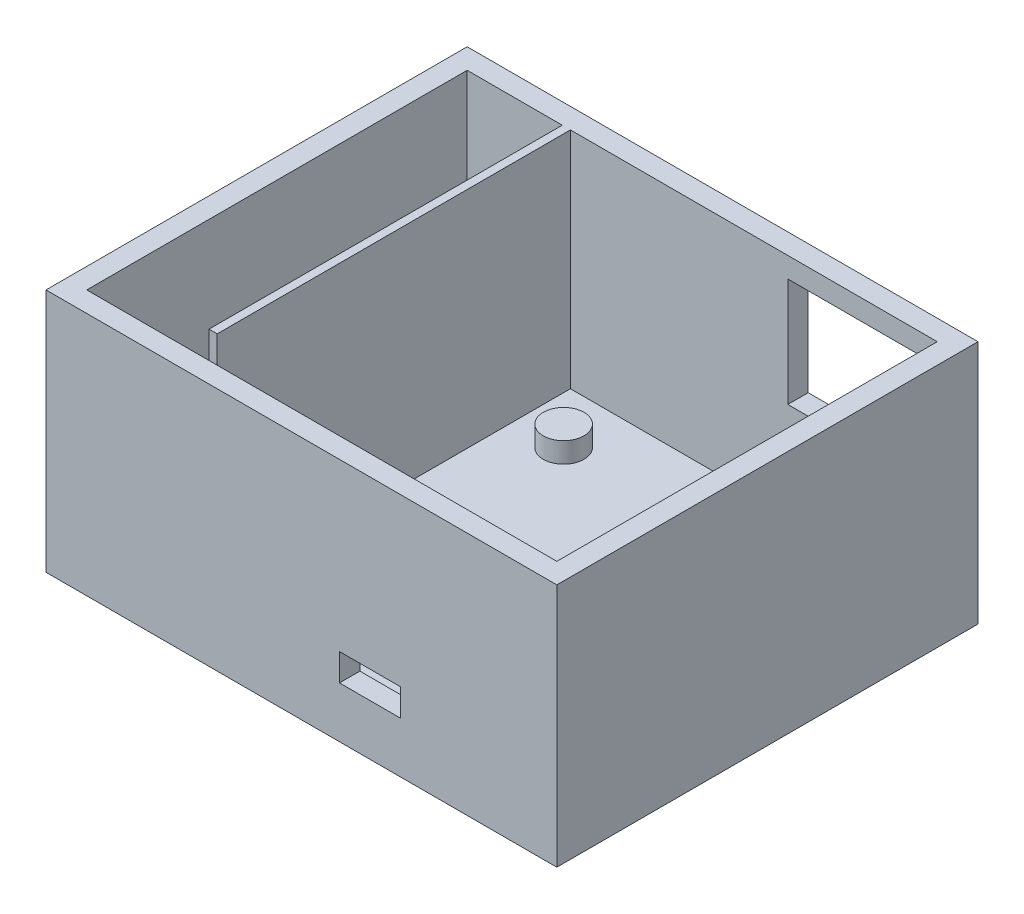
ISO-10303-21;
HEADER;
FILE_DESCRIPTION(('STEP AP214'),'2;1');
FILE_NAME('part.step','',(''),(''),'','','');
FILE_SCHEMA(('AUTOMOTIVE_DESIGN { 1 0 10303 214 1 1 1 1 }'));
ENDSEC;
DATA;
#1=APPLICATION_CONTEXT('core data for automotive mechanical design processes');
#2=APPLICATION_PROTOCOL_DEFINITION('international standard','automotive_design',2000,#1);
#3=PRODUCT_CONTEXT('',#1,'mechanical');
#4=PRODUCT('Part','Part','',(#3));
#5=PRODUCT_RELATED_PRODUCT_CATEGORY('part','',(#4));
#6=PRODUCT_DEFINITION_FORMATION('','',#4);
#7=PRODUCT_DEFINITION_CONTEXT('part definition',#1,'design');
#8=PRODUCT_DEFINITION('design','',#6,#7);
#9=PRODUCT_DEFINITION_SHAPE('','',#8);
#10=(LENGTH_UNIT() NAMED_UNIT(*) SI_UNIT(.MILLI.,.METRE.));
#11=(NAMED_UNIT(*) PLANE_ANGLE_UNIT() SI_UNIT($,.RADIAN.));
#12=(NAMED_UNIT(*) SI_UNIT($,.STERADIAN.) SOLID_ANGLE_UNIT());
#13=UNCERTAINTY_MEASURE_WITH_UNIT(LENGTH_MEASURE(1.E-05),#10,'distance_accuracy_value','');
#14=(GEOMETRIC_REPRESENTATION_CONTEXT(3) GLOBAL_UNCERTAINTY_ASSIGNED_CONTEXT((#13)) GLOBAL_UNIT_ASSIGNED_CONTEXT((#10,
#11,#12)) REPRESENTATION_CONTEXT('',''));
#15=CARTESIAN_POINT('',(0.,0.,0.));
#16=DIRECTION('',(0.,0.,1.));
#17=DIRECTION('',(1.,0.,0.));
#18=AXIS2_PLACEMENT_3D('',#15,#16,#17);
#19=CARTESIAN_POINT('',(0.,3.,0.));
#20=DIRECTION('',(0.,1.,0.));
#21=DIRECTION('',(0.,0.,1.));
#22=AXIS2_PLACEMENT_3D('',#19,#20,#21);
#23=PLANE('',#22);
#24=DIRECTION('',(-1.,0.,0.));
#25=VECTOR('',#24,1.);
#26=CARTESIAN_POINT('',(0.,3.,0.));
#27=LINE('',#26,#25);
#28=CARTESIAN_POINT('',(0.,3.,0.));
#29=VERTEX_POINT('',#28);
#30=CARTESIAN_POINT('',(-54.,3.,0.));
#31=VERTEX_POINT('',#30);
#32=EDGE_CURVE('E306',#29,#31,#27,.T.);
#33=ORIENTED_EDGE('',*,*,#32,.T.);
#34=DIRECTION('',(0.,0.,-1.));
#35=VECTOR('',#34,1.);
#36=CARTESIAN_POINT('',(-54.,3.,0.));
#37=LINE('',#36,#35);
#38=CARTESIAN_POINT('',(-54.,3.,56.));
#39=VERTEX_POINT('',#38);
#40=EDGE_CURVE('E324',#39,#31,#37,.T.);
#41=ORIENTED_EDGE('',*,*,#40,.F.);
#42=DIRECTION('',(-1.,0.,0.));
#43=VECTOR('',#42,1.);
#44=CARTESIAN_POINT('',(0.,3.,56.));
#45=LINE('',#44,#43);
#46=CARTESIAN_POINT('',(0.,3.,56.));
#47=VERTEX_POINT('',#46);
#48=EDGE_CURVE('E327',#47,#39,#45,.T.);
#49=ORIENTED_EDGE('',*,*,#48,.F.);
#50=DIRECTION('',(0.,0.,-1.));
#51=VECTOR('',#50,1.);
#52=CARTESIAN_POINT('',(0.,3.,0.));
#53=LINE('',#52,#51);
#54=EDGE_CURVE('E318',#47,#29,#53,.T.);
#55=ORIENTED_EDGE('',*,*,#54,.T.);
#56=EDGE_LOOP('',(#33,#41,#49,#55));
#57=FACE_BOUND('',#56,.T.);
#58=CARTESIAN_POINT('',(-47.,3.,8.));
#59=DIRECTION('',(0.,1.,0.));
#60=DIRECTION('',(0.,0.,1.));
#61=AXIS2_PLACEMENT_3D('',#58,#59,#60);
#62=CIRCLE('',#61,3.);
#63=CARTESIAN_POINT('',(-47.,3.,11.));
#64=VERTEX_POINT('',#63);
#65=EDGE_CURVE('E384',#64,#64,#62,.T.);
#66=ORIENTED_EDGE('',*,*,#65,.F.);
#67=EDGE_LOOP('',(#66));
#68=FACE_BOUND('',#67,.T.);
#69=CARTESIAN_POINT('',(-5.,3.,8.));
#70=DIRECTION('',(0.,1.,0.));
#71=DIRECTION('',(0.,0.,1.));
#72=AXIS2_PLACEMENT_3D('',#69,#70,#71);
#73=CIRCLE('',#72,3.);
#74=CARTESIAN_POINT('',(-5.,3.,11.));
#75=VERTEX_POINT('',#74);
#76=EDGE_CURVE('E388',#75,#75,#73,.T.);
#77=ORIENTED_EDGE('',*,*,#76,.F.);
#78=EDGE_LOOP('',(#77));
#79=FACE_BOUND('',#78,.T.);
#80=CARTESIAN_POINT('',(-4.99999999999999,3.,50.));
#81=DIRECTION('',(0.,1.,0.));
#82=DIRECTION('',(0.,0.,1.));
#83=AXIS2_PLACEMENT_3D('',#80,#81,#82);
#84=CIRCLE('',#83,3.);
#85=CARTESIAN_POINT('',(-4.99999999999999,3.,53.));
#86=VERTEX_POINT('',#85);
#87=EDGE_CURVE('E394',#86,#86,#84,.T.);
#88=ORIENTED_EDGE('',*,*,#87,.F.);
#89=EDGE_LOOP('',(#88));
#90=FACE_BOUND('',#89,.T.);
#91=CARTESIAN_POINT('',(-47.,3.,50.));
#92=DIRECTION('',(0.,1.,0.));
#93=DIRECTION('',(0.,0.,1.));
#94=AXIS2_PLACEMENT_3D('',#91,#92,#93);
#95=CIRCLE('',#94,3.);
#96=CARTESIAN_POINT('',(-47.,3.,53.));
#97=VERTEX_POINT('',#96);
#98=EDGE_CURVE('E400',#97,#97,#95,.T.);
#99=ORIENTED_EDGE('',*,*,#98,.F.);
#100=EDGE_LOOP('',(#99));
#101=FACE_BOUND('',#100,.T.);
#102=ADVANCED_FACE('F81',(#57,#68,#79,#90,#101),#23,.T.);
#103=CARTESIAN_POINT('',(-47.,6.,50.));
#104=DIRECTION('',(0.,-1.,0.));
#105=DIRECTION('',(0.,0.,-1.));
#106=AXIS2_PLACEMENT_3D('',#103,#104,#105);
#107=CYLINDRICAL_SURFACE('',#106,3.);
#108=CARTESIAN_POINT('',(-47.,6.,50.));
#109=DIRECTION('',(0.,1.,0.));
#110=DIRECTION('',(0.,0.,1.));
#111=AXIS2_PLACEMENT_3D('',#108,#109,#110);
#112=CIRCLE('',#111,3.);
#113=CARTESIAN_POINT('',(-47.,6.,53.));
#114=VERTEX_POINT('',#113);
#115=EDGE_CURVE('E403',#114,#114,#112,.T.);
#116=ORIENTED_EDGE('',*,*,#115,.F.);
#117=EDGE_LOOP('',(#116));
#118=FACE_BOUND('',#117,.T.);
#119=ORIENTED_EDGE('',*,*,#98,.T.);
#120=EDGE_LOOP('',(#119));
#121=FACE_BOUND('',#120,.T.);
#122=ADVANCED_FACE('F448',(#118,#121),#107,.T.);
#123=CARTESIAN_POINT('',(-47.,6.,50.));
#124=DIRECTION('',(0.,1.,0.));
#125=DIRECTION('',(0.,0.,1.));
#126=AXIS2_PLACEMENT_3D('',#123,#124,#125);
#127=PLANE('',#126);
#128=ORIENTED_EDGE('',*,*,#115,.T.);
#129=EDGE_LOOP('',(#128));
#130=FACE_BOUND('',#129,.T.);
#131=ADVANCED_FACE('F455',(#130),#127,.T.);
#132=CARTESIAN_POINT('',(-4.99999999999999,6.,50.));
#133=DIRECTION('',(0.,-1.,0.));
#134=DIRECTION('',(0.,0.,-1.));
#135=AXIS2_PLACEMENT_3D('',#132,#133,#134);
#136=CYLINDRICAL_SURFACE('',#135,3.);
#137=CARTESIAN_POINT('',(-4.99999999999999,6.,50.));
#138=DIRECTION('',(0.,1.,0.));
#139=DIRECTION('',(0.,0.,1.));
#140=AXIS2_PLACEMENT_3D('',#137,#138,#139);
#141=CIRCLE('',#140,3.);
#142=CARTESIAN_POINT('',(-4.99999999999999,6.,53.));
#143=VERTEX_POINT('',#142);
#144=EDGE_CURVE('E397',#143,#143,#141,.T.);
#145=ORIENTED_EDGE('',*,*,#144,.F.);
#146=EDGE_LOOP('',(#145));
#147=FACE_BOUND('',#146,.T.);
#148=ORIENTED_EDGE('',*,*,#87,.T.);
#149=EDGE_LOOP('',(#148));
#150=FACE_BOUND('',#149,.T.);
#151=ADVANCED_FACE('F570',(#147,#150),#136,.T.);
#152=CARTESIAN_POINT('',(-4.99999999999999,6.,50.));
#153=DIRECTION('',(0.,1.,0.));
#154=DIRECTION('',(0.,0.,1.));
#155=AXIS2_PLACEMENT_3D('',#152,#153,#154);
#156=PLANE('',#155);
#157=ORIENTED_EDGE('',*,*,#144,.T.);
#158=EDGE_LOOP('',(#157));
#159=FACE_BOUND('',#158,.T.);
#160=ADVANCED_FACE('F566',(#159),#156,.T.);
#161=CARTESIAN_POINT('',(-5.,6.,8.));
#162=DIRECTION('',(0.,-1.,0.));
#163=DIRECTION('',(0.,0.,-1.));
#164=AXIS2_PLACEMENT_3D('',#161,#162,#163);
#165=CYLINDRICAL_SURFACE('',#164,3.);
#166=CARTESIAN_POINT('',(-5.,6.,8.));
#167=DIRECTION('',(0.,1.,0.));
#168=DIRECTION('',(0.,0.,1.));
#169=AXIS2_PLACEMENT_3D('',#166,#167,#168);
#170=CIRCLE('',#169,3.);
#171=CARTESIAN_POINT('',(-5.,6.,11.));
#172=VERTEX_POINT('',#171);
#173=EDGE_CURVE('E391',#172,#172,#170,.T.);
#174=ORIENTED_EDGE('',*,*,#173,.F.);
#175=EDGE_LOOP('',(#174));
#176=FACE_BOUND('',#175,.T.);
#177=ORIENTED_EDGE('',*,*,#76,.T.);
#178=EDGE_LOOP('',(#177));
#179=FACE_BOUND('',#178,.T.);
#180=ADVANCED_FACE('F562',(#176,#179),#165,.T.);
#181=CARTESIAN_POINT('',(-5.,6.,8.));
#182=DIRECTION('',(0.,1.,0.));
#183=DIRECTION('',(0.,0.,1.));
#184=AXIS2_PLACEMENT_3D('',#181,#182,#183);
#185=PLANE('',#184);
#186=ORIENTED_EDGE('',*,*,#173,.T.);
#187=EDGE_LOOP('',(#186));
#188=FACE_BOUND('',#187,.T.);
#189=ADVANCED_FACE('F558',(#188),#185,.T.);
#190=CARTESIAN_POINT('',(-47.,6.,8.));
#191=DIRECTION('',(0.,-1.,0.));
#192=DIRECTION('',(0.,0.,-1.));
#193=AXIS2_PLACEMENT_3D('',#190,#191,#192);
#194=CYLINDRICAL_SURFACE('',#193,3.);
#195=CARTESIAN_POINT('',(-47.,6.,8.));
#196=DIRECTION('',(0.,1.,0.));
#197=DIRECTION('',(0.,0.,1.));
#198=AXIS2_PLACEMENT_3D('',#195,#196,#197);
#199=CIRCLE('',#198,3.);
#200=CARTESIAN_POINT('',(-47.,6.,11.));
#201=VERTEX_POINT('',#200);
#202=EDGE_CURVE('E385',#201,#201,#199,.T.);
#203=ORIENTED_EDGE('',*,*,#202,.F.);
#204=EDGE_LOOP('',(#203));
#205=FACE_BOUND('',#204,.T.);
#206=ORIENTED_EDGE('',*,*,#65,.T.);
#207=EDGE_LOOP('',(#206));
#208=FACE_BOUND('',#207,.T.);
#209=ADVANCED_FACE('F554',(#205,#208),#194,.T.);
#210=CARTESIAN_POINT('',(-47.,6.,8.));
#211=DIRECTION('',(0.,1.,0.));
#212=DIRECTION('',(0.,0.,1.));
#213=AXIS2_PLACEMENT_3D('',#210,#211,#212);
#214=PLANE('',#213);
#215=ORIENTED_EDGE('',*,*,#202,.T.);
#216=EDGE_LOOP('',(#215));
#217=FACE_BOUND('',#216,.T.);
#218=ADVANCED_FACE('F551',(#217),#214,.T.);
#219=CARTESIAN_POINT('',(0.,36.,0.));
#220=DIRECTION('',(0.,-1.,0.));
#221=DIRECTION('',(0.,0.,-1.));
#222=AXIS2_PLACEMENT_3D('',#219,#220,#221);
#223=PLANE('',#222);
#224=DIRECTION('',(0.,0.,-1.));
#225=VECTOR('',#224,1.);
#226=CARTESIAN_POINT('',(0.,36.,0.));
#227=LINE('',#226,#225);
#228=CARTESIAN_POINT('',(0.,36.,56.));
#229=VERTEX_POINT('',#228);
#230=CARTESIAN_POINT('',(0.,36.,0.));
#231=VERTEX_POINT('',#230);
#232=EDGE_CURVE('E320',#229,#231,#227,.T.);
#233=ORIENTED_EDGE('',*,*,#232,.F.);
#234=DIRECTION('',(-1.,0.,0.));
#235=VECTOR('',#234,1.);
#236=CARTESIAN_POINT('',(0.,36.,56.));
#237=LINE('',#236,#235);
#238=CARTESIAN_POINT('',(-69.2,36.,56.));
#239=VERTEX_POINT('',#238);
#240=EDGE_CURVE('E348',#229,#239,#237,.T.);
#241=ORIENTED_EDGE('',*,*,#240,.T.);
#242=DIRECTION('',(0.,0.,-1.));
#243=VECTOR('',#242,1.);
#244=CARTESIAN_POINT('',(-69.2,36.,0.));
#245=LINE('',#244,#243);
#246=CARTESIAN_POINT('',(-69.2,36.,0.));
#247=VERTEX_POINT('',#246);
#248=EDGE_CURVE('E344',#239,#247,#245,.T.);
#249=ORIENTED_EDGE('',*,*,#248,.T.);
#250=DIRECTION('',(-1.,0.,0.));
#251=VECTOR('',#250,1.);
#252=CARTESIAN_POINT('',(0.,36.,0.));
#253=LINE('',#252,#251);
#254=CARTESIAN_POINT('',(-55.2,36.,0.));
#255=VERTEX_POINT('',#254);
#256=EDGE_CURVE('E342',#255,#247,#253,.T.);
#257=ORIENTED_EDGE('',*,*,#256,.F.);
#258=DIRECTION('',(0.,0.,-1.));
#259=VECTOR('',#258,1.);
#260=CARTESIAN_POINT('',(-55.2,36.,0.));
#261=LINE('',#260,#259);
#262=CARTESIAN_POINT('',(-55.2,36.,52.));
#263=VERTEX_POINT('',#262);
#264=EDGE_CURVE('E351',#263,#255,#261,.T.);
#265=ORIENTED_EDGE('',*,*,#264,.F.);
#266=DIRECTION('',(-1.,0.,0.));
#267=VECTOR('',#266,1.);
#268=CARTESIAN_POINT('',(3.00100000000002,36.,52.));
#269=LINE('',#268,#267);
#270=CARTESIAN_POINT('',(-54.,36.,52.));
#271=VERTEX_POINT('',#270);
#272=EDGE_CURVE('E273',#271,#263,#269,.T.);
#273=ORIENTED_EDGE('',*,*,#272,.F.);
#274=DIRECTION('',(0.,0.,-1.));
#275=VECTOR('',#274,1.);
#276=CARTESIAN_POINT('',(-54.,36.,0.));
#277=LINE('',#276,#275);
#278=CARTESIAN_POINT('',(-54.,36.,0.));
#279=VERTEX_POINT('',#278);
#280=EDGE_CURVE('E317',#271,#279,#277,.T.);
#281=ORIENTED_EDGE('',*,*,#280,.T.);
#282=DIRECTION('',(-1.,0.,0.));
#283=VECTOR('',#282,1.);
#284=CARTESIAN_POINT('',(0.,36.,0.));
#285=LINE('',#284,#283);
#286=EDGE_CURVE('E314',#231,#279,#285,.T.);
#287=ORIENTED_EDGE('',*,*,#286,.F.);
#288=EDGE_LOOP('',(#233,#241,#249,#257,#265,#273,#281,#287));
#289=FACE_BOUND('',#288,.T.);
#290=DIRECTION('',(0.,0.,-1.));
#291=VECTOR('',#290,1.);
#292=CARTESIAN_POINT('',(3.,36.,0.));
#293=LINE('',#292,#291);
#294=CARTESIAN_POINT('',(3.00000000000001,36.,59.));
#295=VERTEX_POINT('',#294);
#296=CARTESIAN_POINT('',(3.,36.,-3.));
#297=VERTEX_POINT('',#296);
#298=EDGE_CURVE('E372',#295,#297,#293,.T.);
#299=ORIENTED_EDGE('',*,*,#298,.T.);
#300=DIRECTION('',(1.,0.,0.));
#301=VECTOR('',#300,1.);
#302=CARTESIAN_POINT('',(0.,36.,-3.));
#303=LINE('',#302,#301);
#304=CARTESIAN_POINT('',(-72.2,36.,-2.99999999999999));
#305=VERTEX_POINT('',#304);
#306=EDGE_CURVE('E375',#305,#297,#303,.T.);
#307=ORIENTED_EDGE('',*,*,#306,.F.);
#308=DIRECTION('',(0.,0.,-1.));
#309=VECTOR('',#308,1.);
#310=CARTESIAN_POINT('',(-72.2,36.,0.));
#311=LINE('',#310,#309);
#312=CARTESIAN_POINT('',(-72.2,36.,59.));
#313=VERTEX_POINT('',#312);
#314=EDGE_CURVE('E378',#313,#305,#311,.T.);
#315=ORIENTED_EDGE('',*,*,#314,.F.);
#316=DIRECTION('',(1.,0.,0.));
#317=VECTOR('',#316,1.);
#318=CARTESIAN_POINT('',(0.,36.,59.));
#319=LINE('',#318,#317);
#320=EDGE_CURVE('E381',#313,#295,#319,.T.);
#321=ORIENTED_EDGE('',*,*,#320,.T.);
#322=EDGE_LOOP('',(#299,#307,#315,#321));
#323=FACE_BOUND('',#322,.T.);
#324=ADVANCED_FACE('F438',(#289,#323),#223,.F.);
#325=CARTESIAN_POINT('',(0.,36.,0.));
#326=DIRECTION('',(0.,0.,1.));
#327=DIRECTION('',(1.,0.,0.));
#328=AXIS2_PLACEMENT_3D('',#325,#326,#327);
#329=PLANE('',#328);
#330=DIRECTION('',(-1.,0.,0.));
#331=VECTOR('',#330,1.);
#332=CARTESIAN_POINT('',(0.,3.,0.));
#333=LINE('',#332,#331);
#334=CARTESIAN_POINT('',(-55.2,3.,0.));
#335=VERTEX_POINT('',#334);
#336=CARTESIAN_POINT('',(-69.2,3.,0.));
#337=VERTEX_POINT('',#336);
#338=EDGE_CURVE('E341',#335,#337,#333,.T.);
#339=ORIENTED_EDGE('',*,*,#338,.F.);
#340=DIRECTION('',(0.,-1.,0.));
#341=VECTOR('',#340,1.);
#342=CARTESIAN_POINT('',(-55.2,36.,0.));
#343=LINE('',#342,#341);
#344=EDGE_CURVE('E353',#255,#335,#343,.T.);
#345=ORIENTED_EDGE('',*,*,#344,.F.);
#346=ORIENTED_EDGE('',*,*,#256,.T.);
#347=DIRECTION('',(0.,-1.,0.));
#348=VECTOR('',#347,1.);
#349=CARTESIAN_POINT('',(-69.2,36.,0.));
#350=LINE('',#349,#348);
#351=EDGE_CURVE('E369',#247,#337,#350,.T.);
#352=ORIENTED_EDGE('',*,*,#351,.T.);
#353=EDGE_LOOP('',(#339,#345,#346,#352));
#354=FACE_BOUND('',#353,.T.);
#355=ADVANCED_FACE('F476',(#354),#329,.T.);
#356=CARTESIAN_POINT('',(-69.2,36.,0.));
#357=DIRECTION('',(-1.,0.,0.));
#358=DIRECTION('',(0.,0.,1.));
#359=AXIS2_PLACEMENT_3D('',#356,#357,#358);
#360=PLANE('',#359);
#361=DIRECTION('',(0.,0.,-1.));
#362=VECTOR('',#361,1.);
#363=CARTESIAN_POINT('',(-69.2,3.,0.));
#364=LINE('',#363,#362);
#365=CARTESIAN_POINT('',(-69.2,3.,56.));
#366=VERTEX_POINT('',#365);
#367=EDGE_CURVE('E355',#366,#337,#364,.T.);
#368=ORIENTED_EDGE('',*,*,#367,.T.);
#369=ORIENTED_EDGE('',*,*,#351,.F.);
#370=ORIENTED_EDGE('',*,*,#248,.F.);
#371=DIRECTION('',(0.,-1.,0.));
#372=VECTOR('',#371,1.);
#373=CARTESIAN_POINT('',(-69.2,36.,56.));
#374=LINE('',#373,#372);
#375=EDGE_CURVE('E366',#239,#366,#374,.T.);
#376=ORIENTED_EDGE('',*,*,#375,.T.);
#377=EDGE_LOOP('',(#368,#369,#370,#376));
#378=FACE_BOUND('',#377,.T.);
#379=ADVANCED_FACE('F480',(#378),#360,.F.);
#380=CARTESIAN_POINT('',(0.,36.,56.));
#381=DIRECTION('',(0.,0.,1.));
#382=DIRECTION('',(1.,0.,0.));
#383=AXIS2_PLACEMENT_3D('',#380,#381,#382);
#384=PLANE('',#383);
#385=DIRECTION('',(-1.,0.,0.));
#386=VECTOR('',#385,1.);
#387=CARTESIAN_POINT('',(0.,3.,56.));
#388=LINE('',#387,#386);
#389=CARTESIAN_POINT('',(-55.2,3.,56.));
#390=VERTEX_POINT('',#389);
#391=EDGE_CURVE('E358',#390,#366,#388,.T.);
#392=ORIENTED_EDGE('',*,*,#391,.T.);
#393=ORIENTED_EDGE('',*,*,#375,.F.);
#394=ORIENTED_EDGE('',*,*,#240,.F.);
#395=DIRECTION('',(0.,-1.,0.));
#396=VECTOR('',#395,1.);
#397=CARTESIAN_POINT('',(0.,36.,56.));
#398=LINE('',#397,#396);
#399=EDGE_CURVE('E333',#229,#47,#398,.T.);
#400=ORIENTED_EDGE('',*,*,#399,.T.);
#401=ORIENTED_EDGE('',*,*,#48,.T.);
#402=DIRECTION('',(0.,-1.,0.));
#403=VECTOR('',#402,1.);
#404=CARTESIAN_POINT('',(-54.,36.,56.));
#405=LINE('',#404,#403);
#406=CARTESIAN_POINT('',(-54.,24.,56.));
#407=VERTEX_POINT('',#406);
#408=EDGE_CURVE('E336',#407,#39,#405,.T.);
#409=ORIENTED_EDGE('',*,*,#408,.F.);
#410=DIRECTION('',(-1.,0.,0.));
#411=VECTOR('',#410,1.);
#412=CARTESIAN_POINT('',(3.00100000000002,24.,56.));
#413=LINE('',#412,#411);
#414=CARTESIAN_POINT('',(-55.2,24.,56.));
#415=VERTEX_POINT('',#414);
#416=EDGE_CURVE('E247',#407,#415,#413,.T.);
#417=ORIENTED_EDGE('',*,*,#416,.T.);
#418=DIRECTION('',(0.,-1.,0.));
#419=VECTOR('',#418,1.);
#420=CARTESIAN_POINT('',(-55.2,36.,56.));
#421=LINE('',#420,#419);
#422=EDGE_CURVE('E364',#415,#390,#421,.T.);
#423=ORIENTED_EDGE('',*,*,#422,.T.);
#424=EDGE_LOOP('',(#392,#393,#394,#400,#401,#409,#417,#423));
#425=FACE_BOUND('',#424,.T.);
#426=DIRECTION('',(1.,0.,0.));
#427=VECTOR('',#426,1.);
#428=CARTESIAN_POINT('',(-29.,11.5,56.));
#429=LINE('',#428,#427);
#430=CARTESIAN_POINT('',(-29.,11.5,56.));
#431=VERTEX_POINT('',#430);
#432=CARTESIAN_POINT('',(-20.,11.5,56.));
#433=VERTEX_POINT('',#432);
#434=EDGE_CURVE('E301',#431,#433,#429,.T.);
#435=ORIENTED_EDGE('',*,*,#434,.F.);
#436=DIRECTION('',(0.,1.,0.));
#437=VECTOR('',#436,1.);
#438=CARTESIAN_POINT('',(-29.,7.5,56.));
#439=LINE('',#438,#437);
#440=CARTESIAN_POINT('',(-29.,7.5,56.));
#441=VERTEX_POINT('',#440);
#442=EDGE_CURVE('E286',#441,#431,#439,.T.);
#443=ORIENTED_EDGE('',*,*,#442,.F.);
#444=DIRECTION('',(-1.,0.,0.));
#445=VECTOR('',#444,1.);
#446=CARTESIAN_POINT('',(-29.,7.5,56.));
#447=LINE('',#446,#445);
#448=CARTESIAN_POINT('',(-20.,7.5,56.));
#449=VERTEX_POINT('',#448);
#450=EDGE_CURVE('E283',#449,#441,#447,.T.);
#451=ORIENTED_EDGE('',*,*,#450,.F.);
#452=DIRECTION('',(0.,-1.,0.));
#453=VECTOR('',#452,1.);
#454=CARTESIAN_POINT('',(-20.,7.5,56.));
#455=LINE('',#454,#453);
#456=EDGE_CURVE('E304',#433,#449,#455,.T.);
#457=ORIENTED_EDGE('',*,*,#456,.F.);
#458=EDGE_LOOP('',(#435,#443,#451,#457));
#459=FACE_BOUND('',#458,.T.);
#460=ADVANCED_FACE('F482',(#425,#459),#384,.F.);
#461=CARTESIAN_POINT('',(-55.2,36.,0.));
#462=DIRECTION('',(-1.,0.,0.));
#463=DIRECTION('',(0.,0.,1.));
#464=AXIS2_PLACEMENT_3D('',#461,#462,#463);
#465=PLANE('',#464);
#466=DIRECTION('',(0.,0.,1.));
#467=VECTOR('',#466,1.);
#468=CARTESIAN_POINT('',(-55.2,24.,56.));
#469=LINE('',#468,#467);
#470=CARTESIAN_POINT('',(-55.2,24.,52.));
#471=VERTEX_POINT('',#470);
#472=EDGE_CURVE('E266',#471,#415,#469,.T.);
#473=ORIENTED_EDGE('',*,*,#472,.F.);
#474=DIRECTION('',(0.,-1.,0.));
#475=VECTOR('',#474,1.);
#476=CARTESIAN_POINT('',(-55.2,36.,52.));
#477=LINE('',#476,#475);
#478=EDGE_CURVE('E270',#263,#471,#477,.T.);
#479=ORIENTED_EDGE('',*,*,#478,.F.);
#480=ORIENTED_EDGE('',*,*,#264,.T.);
#481=ORIENTED_EDGE('',*,*,#344,.T.);
#482=DIRECTION('',(0.,0.,-1.));
#483=VECTOR('',#482,1.);
#484=CARTESIAN_POINT('',(-55.2,3.,0.));
#485=LINE('',#484,#483);
#486=EDGE_CURVE('E345',#390,#335,#485,.T.);
#487=ORIENTED_EDGE('',*,*,#486,.F.);
#488=ORIENTED_EDGE('',*,*,#422,.F.);
#489=EDGE_LOOP('',(#473,#479,#480,#481,#487,#488));
#490=FACE_BOUND('',#489,.T.);
#491=ADVANCED_FACE('F487',(#490),#465,.T.);
#492=CARTESIAN_POINT('',(0.,36.,0.));
#493=DIRECTION('',(0.,0.,1.));
#494=DIRECTION('',(1.,0.,0.));
#495=AXIS2_PLACEMENT_3D('',#492,#493,#494);
#496=PLANE('',#495);
#497=DIRECTION('',(0.,-1.,0.));
#498=VECTOR('',#497,1.);
#499=CARTESIAN_POINT('',(-2.,33.,0.));
#500=LINE('',#499,#498);
#501=CARTESIAN_POINT('',(-1.99999999999999,33.,0.));
#502=VERTEX_POINT('',#501);
#503=CARTESIAN_POINT('',(-1.99999999999999,17.,0.));
#504=VERTEX_POINT('',#503);
#505=EDGE_CURVE('E233',#502,#504,#500,.T.);
#506=ORIENTED_EDGE('',*,*,#505,.T.);
#507=DIRECTION('',(-1.,0.,0.));
#508=VECTOR('',#507,1.);
#509=CARTESIAN_POINT('',(-1.99999999999999,17.,0.));
#510=LINE('',#509,#508);
#511=CARTESIAN_POINT('',(-22.,17.,0.));
#512=VERTEX_POINT('',#511);
#513=EDGE_CURVE('E255',#504,#512,#510,.T.);
#514=ORIENTED_EDGE('',*,*,#513,.T.);
#515=DIRECTION('',(0.,1.,0.));
#516=VECTOR('',#515,1.);
#517=CARTESIAN_POINT('',(-22.,33.,0.));
#518=LINE('',#517,#516);
#519=CARTESIAN_POINT('',(-22.,33.,0.));
#520=VERTEX_POINT('',#519);
#521=EDGE_CURVE('E236',#512,#520,#518,.T.);
#522=ORIENTED_EDGE('',*,*,#521,.T.);
#523=DIRECTION('',(1.,0.,0.));
#524=VECTOR('',#523,1.);
#525=CARTESIAN_POINT('',(-1.99999999999999,33.,0.));
#526=LINE('',#525,#524);
#527=EDGE_CURVE('E237',#520,#502,#526,.T.);
#528=ORIENTED_EDGE('',*,*,#527,.T.);
#529=EDGE_LOOP('',(#506,#514,#522,#528));
#530=FACE_BOUND('',#529,.T.);
#531=ORIENTED_EDGE('',*,*,#32,.F.);
#532=DIRECTION('',(0.,-1.,0.));
#533=VECTOR('',#532,1.);
#534=CARTESIAN_POINT('',(0.,36.,0.));
#535=LINE('',#534,#533);
#536=EDGE_CURVE('E322',#231,#29,#535,.T.);
#537=ORIENTED_EDGE('',*,*,#536,.F.);
#538=ORIENTED_EDGE('',*,*,#286,.T.);
#539=DIRECTION('',(0.,-1.,0.));
#540=VECTOR('',#539,1.);
#541=CARTESIAN_POINT('',(-54.,36.,0.));
#542=LINE('',#541,#540);
#543=EDGE_CURVE('E338',#279,#31,#542,.T.);
#544=ORIENTED_EDGE('',*,*,#543,.T.);
#545=EDGE_LOOP('',(#531,#537,#538,#544));
#546=FACE_BOUND('',#545,.T.);
#547=ADVANCED_FACE('F500',(#530,#546),#496,.T.);
#548=CARTESIAN_POINT('',(-54.,36.,0.));
#549=DIRECTION('',(-1.,0.,0.));
#550=DIRECTION('',(0.,0.,1.));
#551=AXIS2_PLACEMENT_3D('',#548,#549,#550);
#552=PLANE('',#551);
#553=DIRECTION('',(0.,1.,0.));
#554=VECTOR('',#553,1.);
#555=CARTESIAN_POINT('',(-54.,36.,52.));
#556=LINE('',#555,#554);
#557=CARTESIAN_POINT('',(-54.,24.,52.));
#558=VERTEX_POINT('',#557);
#559=EDGE_CURVE('E276',#558,#271,#556,.T.);
#560=ORIENTED_EDGE('',*,*,#559,.F.);
#561=DIRECTION('',(0.,0.,-1.));
#562=VECTOR('',#561,1.);
#563=CARTESIAN_POINT('',(-54.,24.,56.));
#564=LINE('',#563,#562);
#565=EDGE_CURVE('E269',#407,#558,#564,.T.);
#566=ORIENTED_EDGE('',*,*,#565,.F.);
#567=ORIENTED_EDGE('',*,*,#408,.T.);
#568=ORIENTED_EDGE('',*,*,#40,.T.);
#569=ORIENTED_EDGE('',*,*,#543,.F.);
#570=ORIENTED_EDGE('',*,*,#280,.F.);
#571=EDGE_LOOP('',(#560,#566,#567,#568,#569,#570));
#572=FACE_BOUND('',#571,.T.);
#573=ADVANCED_FACE('F467',(#572),#552,.F.);
#574=CARTESIAN_POINT('',(0.,36.,0.));
#575=DIRECTION('',(-1.,0.,0.));
#576=DIRECTION('',(0.,0.,1.));
#577=AXIS2_PLACEMENT_3D('',#574,#575,#576);
#578=PLANE('',#577);
#579=ORIENTED_EDGE('',*,*,#54,.F.);
#580=ORIENTED_EDGE('',*,*,#399,.F.);
#581=ORIENTED_EDGE('',*,*,#232,.T.);
#582=ORIENTED_EDGE('',*,*,#536,.T.);
#583=EDGE_LOOP('',(#579,#580,#581,#582));
#584=FACE_BOUND('',#583,.T.);
#585=ADVANCED_FACE('F461',(#584),#578,.T.);
#586=ORIENTED_EDGE('',*,*,#338,.T.);
#587=ORIENTED_EDGE('',*,*,#367,.F.);
#588=ORIENTED_EDGE('',*,*,#391,.F.);
#589=ORIENTED_EDGE('',*,*,#486,.T.);
#590=EDGE_LOOP('',(#586,#587,#588,#589));
#591=FACE_BOUND('',#590,.T.);
#592=ADVANCED_FACE('F451',(#591),#23,.T.);
#593=CARTESIAN_POINT('',(0.,0.,0.));
#594=DIRECTION('',(0.,1.,0.));
#595=DIRECTION('',(0.,0.,1.));
#596=AXIS2_PLACEMENT_3D('',#593,#594,#595);
#597=PLANE('',#596);
#598=DIRECTION('',(-1.,0.,0.));
#599=VECTOR('',#598,1.);
#600=CARTESIAN_POINT('',(0.,0.,-3.));
#601=LINE('',#600,#599);
#602=CARTESIAN_POINT('',(3.,0.,-3.));
#603=VERTEX_POINT('',#602);
#604=CARTESIAN_POINT('',(-72.2,0.,-2.99999999999999));
#605=VERTEX_POINT('',#604);
#606=EDGE_CURVE('E406',#603,#605,#601,.T.);
#607=ORIENTED_EDGE('',*,*,#606,.F.);
#608=DIRECTION('',(0.,0.,1.));
#609=VECTOR('',#608,1.);
#610=CARTESIAN_POINT('',(3.,0.,0.));
#611=LINE('',#610,#609);
#612=CARTESIAN_POINT('',(3.00000000000001,0.,59.));
#613=VERTEX_POINT('',#612);
#614=EDGE_CURVE('E417',#603,#613,#611,.T.);
#615=ORIENTED_EDGE('',*,*,#614,.T.);
#616=DIRECTION('',(-1.,0.,0.));
#617=VECTOR('',#616,1.);
#618=CARTESIAN_POINT('',(0.,0.,59.));
#619=LINE('',#618,#617);
#620=CARTESIAN_POINT('',(-72.2,0.,59.));
#621=VERTEX_POINT('',#620);
#622=EDGE_CURVE('E414',#613,#621,#619,.T.);
#623=ORIENTED_EDGE('',*,*,#622,.T.);
#624=DIRECTION('',(0.,0.,1.));
#625=VECTOR('',#624,1.);
#626=CARTESIAN_POINT('',(-72.2,0.,0.));
#627=LINE('',#626,#625);
#628=EDGE_CURVE('E411',#605,#621,#627,.T.);
#629=ORIENTED_EDGE('',*,*,#628,.F.);
#630=EDGE_LOOP('',(#607,#615,#623,#629));
#631=FACE_BOUND('',#630,.T.);
#632=ADVANCED_FACE('F432',(#631),#597,.F.);
#633=CARTESIAN_POINT('',(0.,3.,59.));
#634=DIRECTION('',(0.,0.,1.));
#635=DIRECTION('',(1.,0.,0.));
#636=AXIS2_PLACEMENT_3D('',#633,#634,#635);
#637=PLANE('',#636);
#638=DIRECTION('',(0.,-1.,0.));
#639=VECTOR('',#638,1.);
#640=CARTESIAN_POINT('',(-29.,7.5,59.));
#641=LINE('',#640,#639);
#642=CARTESIAN_POINT('',(-29.,11.5,59.));
#643=VERTEX_POINT('',#642);
#644=CARTESIAN_POINT('',(-29.,7.5,59.));
#645=VERTEX_POINT('',#644);
#646=EDGE_CURVE('E296',#643,#645,#641,.T.);
#647=ORIENTED_EDGE('',*,*,#646,.F.);
#648=DIRECTION('',(-1.,0.,0.));
#649=VECTOR('',#648,1.);
#650=CARTESIAN_POINT('',(-29.,11.5,59.));
#651=LINE('',#650,#649);
#652=CARTESIAN_POINT('',(-20.,11.5,59.));
#653=VERTEX_POINT('',#652);
#654=EDGE_CURVE('E287',#653,#643,#651,.T.);
#655=ORIENTED_EDGE('',*,*,#654,.F.);
#656=DIRECTION('',(0.,1.,0.));
#657=VECTOR('',#656,1.);
#658=CARTESIAN_POINT('',(-20.,7.5,59.));
#659=LINE('',#658,#657);
#660=CARTESIAN_POINT('',(-20.,7.5,59.));
#661=VERTEX_POINT('',#660);
#662=EDGE_CURVE('E290',#661,#653,#659,.T.);
#663=ORIENTED_EDGE('',*,*,#662,.F.);
#664=DIRECTION('',(1.,0.,0.));
#665=VECTOR('',#664,1.);
#666=CARTESIAN_POINT('',(-29.,7.5,59.));
#667=LINE('',#666,#665);
#668=EDGE_CURVE('E293',#645,#661,#667,.T.);
#669=ORIENTED_EDGE('',*,*,#668,.F.);
#670=EDGE_LOOP('',(#647,#655,#663,#669));
#671=FACE_BOUND('',#670,.T.);
#672=ORIENTED_EDGE('',*,*,#622,.F.);
#673=DIRECTION('',(0.,-1.,0.));
#674=VECTOR('',#673,1.);
#675=CARTESIAN_POINT('',(3.00000000000001,3.,59.));
#676=LINE('',#675,#674);
#677=EDGE_CURVE('E422',#295,#613,#676,.T.);
#678=ORIENTED_EDGE('',*,*,#677,.F.);
#679=ORIENTED_EDGE('',*,*,#320,.F.);
#680=DIRECTION('',(0.,-1.,0.));
#681=VECTOR('',#680,1.);
#682=CARTESIAN_POINT('',(-72.2,3.,59.));
#683=LINE('',#682,#681);
#684=EDGE_CURVE('E89',#313,#621,#683,.T.);
#685=ORIENTED_EDGE('',*,*,#684,.T.);
#686=EDGE_LOOP('',(#672,#678,#679,#685));
#687=FACE_BOUND('',#686,.T.);
#688=ADVANCED_FACE('F426',(#671,#687),#637,.T.);
#689=CARTESIAN_POINT('',(-72.2,3.,0.));
#690=DIRECTION('',(1.,0.,0.));
#691=DIRECTION('',(0.,0.,-1.));
#692=AXIS2_PLACEMENT_3D('',#689,#690,#691);
#693=PLANE('',#692);
#694=ORIENTED_EDGE('',*,*,#628,.T.);
#695=ORIENTED_EDGE('',*,*,#684,.F.);
#696=ORIENTED_EDGE('',*,*,#314,.T.);
#697=DIRECTION('',(0.,-1.,0.));
#698=VECTOR('',#697,1.);
#699=CARTESIAN_POINT('',(-72.2,3.,-2.99999999999999));
#700=LINE('',#699,#698);
#701=EDGE_CURVE('E12',#305,#605,#700,.T.);
#702=ORIENTED_EDGE('',*,*,#701,.T.);
#703=EDGE_LOOP('',(#694,#695,#696,#702));
#704=FACE_BOUND('',#703,.T.);
#705=ADVANCED_FACE('F429',(#704),#693,.F.);
#706=CARTESIAN_POINT('',(0.,3.,-3.));
#707=DIRECTION('',(0.,0.,1.));
#708=DIRECTION('',(1.,0.,0.));
#709=AXIS2_PLACEMENT_3D('',#706,#707,#708);
#710=PLANE('',#709);
#711=DIRECTION('',(-1.,0.,0.));
#712=VECTOR('',#711,1.);
#713=CARTESIAN_POINT('',(-2.,17.,-3.));
#714=LINE('',#713,#712);
#715=CARTESIAN_POINT('',(-2.,17.,-3.));
#716=VERTEX_POINT('',#715);
#717=CARTESIAN_POINT('',(-22.,17.,-3.));
#718=VERTEX_POINT('',#717);
#719=EDGE_CURVE('E252',#716,#718,#714,.T.);
#720=ORIENTED_EDGE('',*,*,#719,.F.);
#721=DIRECTION('',(0.,-1.,0.));
#722=VECTOR('',#721,1.);
#723=CARTESIAN_POINT('',(-2.,33.,-3.));
#724=LINE('',#723,#722);
#725=CARTESIAN_POINT('',(-2.,33.,-3.));
#726=VERTEX_POINT('',#725);
#727=EDGE_CURVE('E104',#726,#716,#724,.T.);
#728=ORIENTED_EDGE('',*,*,#727,.F.);
#729=DIRECTION('',(1.,0.,0.));
#730=VECTOR('',#729,1.);
#731=CARTESIAN_POINT('',(-2.,33.,-3.));
#732=LINE('',#731,#730);
#733=CARTESIAN_POINT('',(-22.,33.,-3.));
#734=VERTEX_POINT('',#733);
#735=EDGE_CURVE('E240',#734,#726,#732,.T.);
#736=ORIENTED_EDGE('',*,*,#735,.F.);
#737=DIRECTION('',(0.,1.,0.));
#738=VECTOR('',#737,1.);
#739=CARTESIAN_POINT('',(-22.,33.,-3.));
#740=LINE('',#739,#738);
#741=EDGE_CURVE('E248',#718,#734,#740,.T.);
#742=ORIENTED_EDGE('',*,*,#741,.F.);
#743=EDGE_LOOP('',(#720,#728,#736,#742));
#744=FACE_BOUND('',#743,.T.);
#745=ORIENTED_EDGE('',*,*,#606,.T.);
#746=ORIENTED_EDGE('',*,*,#701,.F.);
#747=ORIENTED_EDGE('',*,*,#306,.T.);
#748=DIRECTION('',(0.,-1.,0.));
#749=VECTOR('',#748,1.);
#750=CARTESIAN_POINT('',(3.,3.,-3.));
#751=LINE('',#750,#749);
#752=EDGE_CURVE('E420',#297,#603,#751,.T.);
#753=ORIENTED_EDGE('',*,*,#752,.T.);
#754=EDGE_LOOP('',(#745,#746,#747,#753));
#755=FACE_BOUND('',#754,.T.);
#756=ADVANCED_FACE('F83',(#744,#755),#710,.F.);
#757=CARTESIAN_POINT('',(3.,3.,0.));
#758=DIRECTION('',(1.,0.,0.));
#759=DIRECTION('',(0.,0.,-1.));
#760=AXIS2_PLACEMENT_3D('',#757,#758,#759);
#761=PLANE('',#760);
#762=ORIENTED_EDGE('',*,*,#614,.F.);
#763=ORIENTED_EDGE('',*,*,#752,.F.);
#764=ORIENTED_EDGE('',*,*,#298,.F.);
#765=ORIENTED_EDGE('',*,*,#677,.T.);
#766=EDGE_LOOP('',(#762,#763,#764,#765));
#767=FACE_BOUND('',#766,.T.);
#768=ADVANCED_FACE('F435',(#767),#761,.T.);
#769=CARTESIAN_POINT('',(-29.,7.5,-3.001));
#770=DIRECTION('',(-1.,0.,0.));
#771=DIRECTION('',(0.,0.,1.));
#772=AXIS2_PLACEMENT_3D('',#769,#770,#771);
#773=PLANE('',#772);
#774=ORIENTED_EDGE('',*,*,#442,.T.);
#775=DIRECTION('',(0.,0.,1.));
#776=VECTOR('',#775,1.);
#777=CARTESIAN_POINT('',(-29.,11.5,-3.001));
#778=LINE('',#777,#776);
#779=EDGE_CURVE('E307',#431,#643,#778,.T.);
#780=ORIENTED_EDGE('',*,*,#779,.T.);
#781=ORIENTED_EDGE('',*,*,#646,.T.);
#782=DIRECTION('',(0.,0.,1.));
#783=VECTOR('',#782,1.);
#784=CARTESIAN_POINT('',(-29.,7.5,-3.001));
#785=LINE('',#784,#783);
#786=EDGE_CURVE('E278',#441,#645,#785,.T.);
#787=ORIENTED_EDGE('',*,*,#786,.F.);
#788=EDGE_LOOP('',(#774,#780,#781,#787));
#789=FACE_BOUND('',#788,.T.);
#790=ADVANCED_FACE('F445',(#789),#773,.F.);
#791=CARTESIAN_POINT('',(-29.,11.5,-3.001));
#792=DIRECTION('',(0.,1.,0.));
#793=DIRECTION('',(0.,0.,1.));
#794=AXIS2_PLACEMENT_3D('',#791,#792,#793);
#795=PLANE('',#794);
#796=ORIENTED_EDGE('',*,*,#434,.T.);
#797=DIRECTION('',(0.,0.,1.));
#798=VECTOR('',#797,1.);
#799=CARTESIAN_POINT('',(-20.,11.5,-3.001));
#800=LINE('',#799,#798);
#801=EDGE_CURVE('E309',#433,#653,#800,.T.);
#802=ORIENTED_EDGE('',*,*,#801,.T.);
#803=ORIENTED_EDGE('',*,*,#654,.T.);
#804=ORIENTED_EDGE('',*,*,#779,.F.);
#805=EDGE_LOOP('',(#796,#802,#803,#804));
#806=FACE_BOUND('',#805,.T.);
#807=ADVANCED_FACE('F528',(#806),#795,.F.);
#808=CARTESIAN_POINT('',(-20.,7.5,-3.001));
#809=DIRECTION('',(1.,0.,0.));
#810=DIRECTION('',(0.,0.,-1.));
#811=AXIS2_PLACEMENT_3D('',#808,#809,#810);
#812=PLANE('',#811);
#813=ORIENTED_EDGE('',*,*,#456,.T.);
#814=DIRECTION('',(0.,0.,1.));
#815=VECTOR('',#814,1.);
#816=CARTESIAN_POINT('',(-20.,7.5,-3.001));
#817=LINE('',#816,#815);
#818=EDGE_CURVE('E298',#449,#661,#817,.T.);
#819=ORIENTED_EDGE('',*,*,#818,.T.);
#820=ORIENTED_EDGE('',*,*,#662,.T.);
#821=ORIENTED_EDGE('',*,*,#801,.F.);
#822=EDGE_LOOP('',(#813,#819,#820,#821));
#823=FACE_BOUND('',#822,.T.);
#824=ADVANCED_FACE('F524',(#823),#812,.F.);
#825=CARTESIAN_POINT('',(-29.,7.5,-3.001));
#826=DIRECTION('',(0.,-1.,0.));
#827=DIRECTION('',(0.,0.,-1.));
#828=AXIS2_PLACEMENT_3D('',#825,#826,#827);
#829=PLANE('',#828);
#830=ORIENTED_EDGE('',*,*,#450,.T.);
#831=ORIENTED_EDGE('',*,*,#786,.T.);
#832=ORIENTED_EDGE('',*,*,#668,.T.);
#833=ORIENTED_EDGE('',*,*,#818,.F.);
#834=EDGE_LOOP('',(#830,#831,#832,#833));
#835=FACE_BOUND('',#834,.T.);
#836=ADVANCED_FACE('F518',(#835),#829,.F.);
#837=CARTESIAN_POINT('',(3.00100000000002,24.,56.));
#838=DIRECTION('',(0.,-1.,0.));
#839=DIRECTION('',(0.,0.,-1.));
#840=AXIS2_PLACEMENT_3D('',#837,#838,#839);
#841=PLANE('',#840);
#842=ORIENTED_EDGE('',*,*,#565,.T.);
#843=DIRECTION('',(-1.,0.,0.));
#844=VECTOR('',#843,1.);
#845=CARTESIAN_POINT('',(3.00100000000002,24.,52.));
#846=LINE('',#845,#844);
#847=EDGE_CURVE('E280',#558,#471,#846,.T.);
#848=ORIENTED_EDGE('',*,*,#847,.T.);
#849=ORIENTED_EDGE('',*,*,#472,.T.);
#850=ORIENTED_EDGE('',*,*,#416,.F.);
#851=EDGE_LOOP('',(#842,#848,#849,#850));
#852=FACE_BOUND('',#851,.T.);
#853=ADVANCED_FACE('F508',(#852),#841,.F.);
#854=CARTESIAN_POINT('',(3.00100000000002,36.,52.));
#855=DIRECTION('',(0.,0.,-1.));
#856=DIRECTION('',(-1.,0.,0.));
#857=AXIS2_PLACEMENT_3D('',#854,#855,#856);
#858=PLANE('',#857);
#859=ORIENTED_EDGE('',*,*,#559,.T.);
#860=ORIENTED_EDGE('',*,*,#272,.T.);
#861=ORIENTED_EDGE('',*,*,#478,.T.);
#862=ORIENTED_EDGE('',*,*,#847,.F.);
#863=EDGE_LOOP('',(#859,#860,#861,#862));
#864=FACE_BOUND('',#863,.T.);
#865=ADVANCED_FACE('F510',(#864),#858,.F.);
#866=CARTESIAN_POINT('',(-1.99999999999999,33.,59.001));
#867=DIRECTION('',(1.,0.,0.));
#868=DIRECTION('',(0.,0.,-1.));
#869=AXIS2_PLACEMENT_3D('',#866,#867,#868);
#870=PLANE('',#869);
#871=DIRECTION('',(0.,0.,-1.));
#872=VECTOR('',#871,1.);
#873=CARTESIAN_POINT('',(-1.99999999999999,33.,59.001));
#874=LINE('',#873,#872);
#875=EDGE_CURVE('E229',#502,#726,#874,.T.);
#876=ORIENTED_EDGE('',*,*,#875,.T.);
#877=ORIENTED_EDGE('',*,*,#727,.T.);
#878=DIRECTION('',(0.,0.,-1.));
#879=VECTOR('',#878,1.);
#880=CARTESIAN_POINT('',(-1.99999999999999,17.,59.001));
#881=LINE('',#880,#879);
#882=EDGE_CURVE('E260',#504,#716,#881,.T.);
#883=ORIENTED_EDGE('',*,*,#882,.F.);
#884=ORIENTED_EDGE('',*,*,#505,.F.);
#885=EDGE_LOOP('',(#876,#877,#883,#884));
#886=FACE_BOUND('',#885,.T.);
#887=ADVANCED_FACE('F231',(#886),#870,.F.);
#888=CARTESIAN_POINT('',(-1.99999999999999,33.,59.001));
#889=DIRECTION('',(0.,1.,0.));
#890=DIRECTION('',(0.,0.,1.));
#891=AXIS2_PLACEMENT_3D('',#888,#889,#890);
#892=PLANE('',#891);
#893=DIRECTION('',(0.,0.,-1.));
#894=VECTOR('',#893,1.);
#895=CARTESIAN_POINT('',(-22.,33.,59.001));
#896=LINE('',#895,#894);
#897=EDGE_CURVE('E243',#520,#734,#896,.T.);
#898=ORIENTED_EDGE('',*,*,#897,.T.);
#899=ORIENTED_EDGE('',*,*,#735,.T.);
#900=ORIENTED_EDGE('',*,*,#875,.F.);
#901=ORIENTED_EDGE('',*,*,#527,.F.);
#902=EDGE_LOOP('',(#898,#899,#900,#901));
#903=FACE_BOUND('',#902,.T.);
#904=ADVANCED_FACE('F241',(#903),#892,.F.);
#905=CARTESIAN_POINT('',(-22.,33.,59.001));
#906=DIRECTION('',(-1.,0.,0.));
#907=DIRECTION('',(0.,0.,1.));
#908=AXIS2_PLACEMENT_3D('',#905,#906,#907);
#909=PLANE('',#908);
#910=DIRECTION('',(0.,0.,-1.));
#911=VECTOR('',#910,1.);
#912=CARTESIAN_POINT('',(-22.,17.,59.001));
#913=LINE('',#912,#911);
#914=EDGE_CURVE('E96',#512,#718,#913,.T.);
#915=ORIENTED_EDGE('',*,*,#914,.T.);
#916=ORIENTED_EDGE('',*,*,#741,.T.);
#917=ORIENTED_EDGE('',*,*,#897,.F.);
#918=ORIENTED_EDGE('',*,*,#521,.F.);
#919=EDGE_LOOP('',(#915,#916,#917,#918));
#920=FACE_BOUND('',#919,.T.);
#921=ADVANCED_FACE('F721',(#920),#909,.F.);
#922=CARTESIAN_POINT('',(-1.99999999999999,17.,59.001));
#923=DIRECTION('',(0.,-1.,0.));
#924=DIRECTION('',(0.,0.,-1.));
#925=AXIS2_PLACEMENT_3D('',#922,#923,#924);
#926=PLANE('',#925);
#927=ORIENTED_EDGE('',*,*,#882,.T.);
#928=ORIENTED_EDGE('',*,*,#719,.T.);
#929=ORIENTED_EDGE('',*,*,#914,.F.);
#930=ORIENTED_EDGE('',*,*,#513,.F.);
#931=EDGE_LOOP('',(#927,#928,#929,#930));
#932=FACE_BOUND('',#931,.T.);
#933=ADVANCED_FACE('F728',(#932),#926,.F.);
#934=CLOSED_SHELL('',(#102,#122,#131,#151,#160,#180,#189,#209,#218,#324,#355,#379,#460,#491,
#547,#573,#585,#592,#632,#688,#705,#756,#768,#790,#807,#824,#836,#853,#865,#887,#904,#921,#933));
#935=MANIFOLD_SOLID_BREP('B2',#934);
#936=ADVANCED_BREP_SHAPE_REPRESENTATION('',(#18,#935),#14);
#937=SHAPE_DEFINITION_REPRESENTATION(#9,#936);
ENDSEC;
END-ISO-10303-21;
